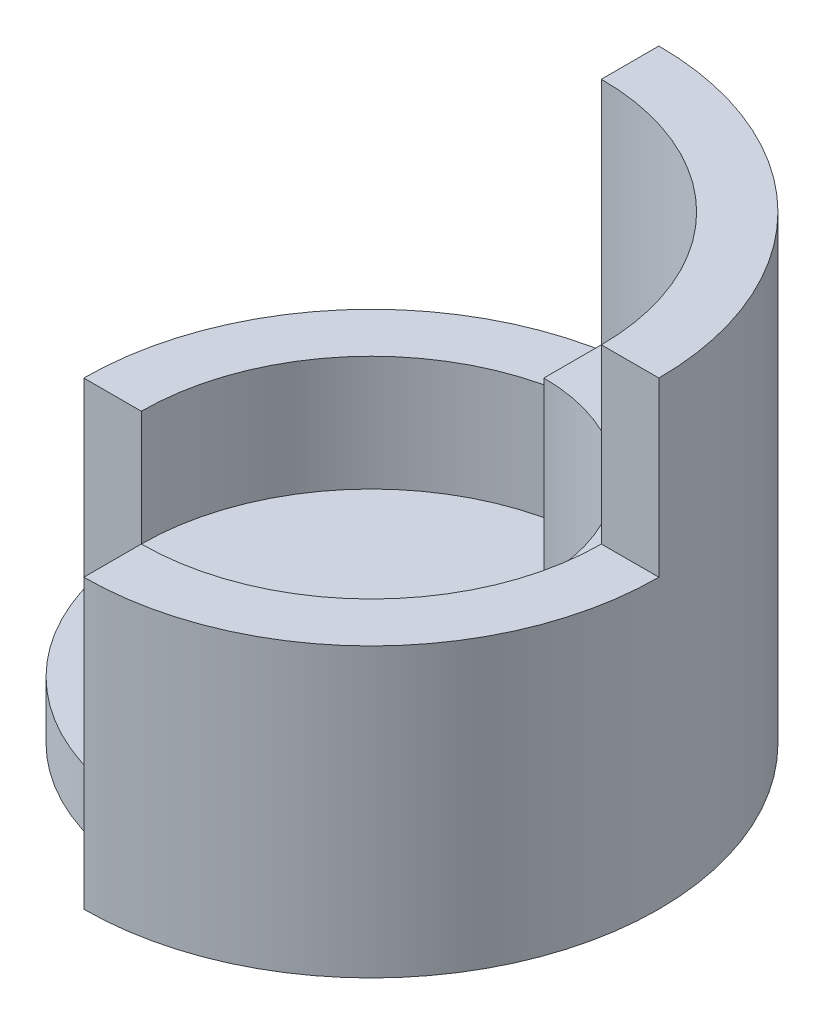
ISO-10303-21;
HEADER;
FILE_DESCRIPTION(('STEP AP214'),'2;1');
FILE_NAME('part.step','',(''),(''),'','','');
FILE_SCHEMA(('AUTOMOTIVE_DESIGN { 1 0 10303 214 1 1 1 1 }'));
ENDSEC;
DATA;
#1=APPLICATION_CONTEXT('core data for automotive mechanical design processes');
#2=APPLICATION_PROTOCOL_DEFINITION('international standard','automotive_design',2000,#1);
#3=PRODUCT_CONTEXT('',#1,'mechanical');
#4=PRODUCT('Part','Part','',(#3));
#5=PRODUCT_RELATED_PRODUCT_CATEGORY('part','',(#4));
#6=PRODUCT_DEFINITION_FORMATION('','',#4);
#7=PRODUCT_DEFINITION_CONTEXT('part definition',#1,'design');
#8=PRODUCT_DEFINITION('design','',#6,#7);
#9=PRODUCT_DEFINITION_SHAPE('','',#8);
#10=(LENGTH_UNIT() NAMED_UNIT(*) SI_UNIT(.MILLI.,.METRE.));
#11=(NAMED_UNIT(*) PLANE_ANGLE_UNIT() SI_UNIT($,.RADIAN.));
#12=(NAMED_UNIT(*) SI_UNIT($,.STERADIAN.) SOLID_ANGLE_UNIT());
#13=UNCERTAINTY_MEASURE_WITH_UNIT(LENGTH_MEASURE(1.E-05),#10,'distance_accuracy_value','');
#14=(GEOMETRIC_REPRESENTATION_CONTEXT(3) GLOBAL_UNCERTAINTY_ASSIGNED_CONTEXT((#13)) GLOBAL_UNIT_ASSIGNED_CONTEXT((#10,
#11,#12)) REPRESENTATION_CONTEXT('',''));
#15=CARTESIAN_POINT('',(0.,0.,0.));
#16=DIRECTION('',(0.,0.,1.));
#17=DIRECTION('',(1.,0.,0.));
#18=AXIS2_PLACEMENT_3D('',#15,#16,#17);
#19=CARTESIAN_POINT('',(0.,5.,-3.));
#20=DIRECTION('',(1.,0.,0.));
#21=DIRECTION('',(0.,0.,-1.));
#22=AXIS2_PLACEMENT_3D('',#19,#20,#21);
#23=PLANE('',#22);
#24=DIRECTION('',(0.,-1.,0.));
#25=VECTOR('',#24,1.);
#26=CARTESIAN_POINT('',(0.,3.,-4.));
#27=LINE('',#26,#25);
#28=CARTESIAN_POINT('',(0.,3.,-4.));
#29=VERTEX_POINT('',#28);
#30=CARTESIAN_POINT('',(0.,1.,-4.));
#31=VERTEX_POINT('',#30);
#32=EDGE_CURVE('E150',#29,#31,#27,.T.);
#33=ORIENTED_EDGE('',*,*,#32,.T.);
#34=DIRECTION('',(0.,0.,1.));
#35=VECTOR('',#34,1.);
#36=CARTESIAN_POINT('',(0.,1.,-3.));
#37=LINE('',#36,#35);
#38=CARTESIAN_POINT('',(0.,1.,-3.));
#39=VERTEX_POINT('',#38);
#40=EDGE_CURVE('E37',#31,#39,#37,.T.);
#41=ORIENTED_EDGE('',*,*,#40,.T.);
#42=DIRECTION('',(0.,-1.,0.));
#43=VECTOR('',#42,1.);
#44=CARTESIAN_POINT('',(0.,5.,-3.));
#45=LINE('',#44,#43);
#46=CARTESIAN_POINT('',(0.,4.,-3.));
#47=VERTEX_POINT('',#46);
#48=EDGE_CURVE('E213',#47,#39,#45,.T.);
#49=ORIENTED_EDGE('',*,*,#48,.F.);
#50=DIRECTION('',(0.,0.,1.));
#51=VECTOR('',#50,1.);
#52=CARTESIAN_POINT('',(0.,4.,-3.));
#53=LINE('',#52,#51);
#54=CARTESIAN_POINT('',(0.,4.,-4.));
#55=VERTEX_POINT('',#54);
#56=EDGE_CURVE('E168',#55,#47,#53,.T.);
#57=ORIENTED_EDGE('',*,*,#56,.F.);
#58=DIRECTION('',(0.,-1.,0.));
#59=VECTOR('',#58,1.);
#60=CARTESIAN_POINT('',(0.,8.,-4.));
#61=LINE('',#60,#59);
#62=CARTESIAN_POINT('',(0.,8.,-4.));
#63=VERTEX_POINT('',#62);
#64=EDGE_CURVE('E185',#63,#55,#61,.T.);
#65=ORIENTED_EDGE('',*,*,#64,.F.);
#66=DIRECTION('',(0.,0.,1.));
#67=VECTOR('',#66,1.);
#68=CARTESIAN_POINT('',(0.,8.,-5.));
#69=LINE('',#68,#67);
#70=CARTESIAN_POINT('',(0.,8.,-5.));
#71=VERTEX_POINT('',#70);
#72=EDGE_CURVE('E182',#71,#63,#69,.T.);
#73=ORIENTED_EDGE('',*,*,#72,.F.);
#74=DIRECTION('',(0.,-1.,0.));
#75=VECTOR('',#74,1.);
#76=CARTESIAN_POINT('',(0.,5.,-5.));
#77=LINE('',#76,#75);
#78=CARTESIAN_POINT('',(0.,3.,-5.));
#79=VERTEX_POINT('',#78);
#80=EDGE_CURVE('E56',#71,#79,#77,.T.);
#81=ORIENTED_EDGE('',*,*,#80,.T.);
#82=DIRECTION('',(0.,0.,-1.));
#83=VECTOR('',#82,1.);
#84=CARTESIAN_POINT('',(0.,3.,-5.));
#85=LINE('',#84,#83);
#86=EDGE_CURVE('E51',#29,#79,#85,.T.);
#87=ORIENTED_EDGE('',*,*,#86,.F.);
#88=EDGE_LOOP('',(#33,#41,#49,#57,#65,#73,#81,#87));
#89=FACE_BOUND('',#88,.T.);
#90=ADVANCED_FACE('F33',(#89),#23,.F.);
#91=CARTESIAN_POINT('',(0.,1.,0.));
#92=DIRECTION('',(0.,1.,0.));
#93=DIRECTION('',(0.,0.,1.));
#94=AXIS2_PLACEMENT_3D('',#91,#92,#93);
#95=PLANE('',#94);
#96=CARTESIAN_POINT('',(0.,1.,0.));
#97=DIRECTION('',(0.,1.,0.));
#98=DIRECTION('',(0.,0.,1.));
#99=AXIS2_PLACEMENT_3D('',#96,#97,#98);
#100=CIRCLE('',#99,1.);
#101=CARTESIAN_POINT('',(0.,1.,1.));
#102=VERTEX_POINT('',#101);
#103=EDGE_CURVE('E209',#102,#102,#100,.T.);
#104=ORIENTED_EDGE('',*,*,#103,.F.);
#105=EDGE_LOOP('',(#104));
#106=FACE_BOUND('',#105,.T.);
#107=ORIENTED_EDGE('',*,*,#40,.F.);
#108=CARTESIAN_POINT('',(0.,1.,0.));
#109=DIRECTION('',(0.,-1.,0.));
#110=DIRECTION('',(0.,0.,1.));
#111=AXIS2_PLACEMENT_3D('',#108,#109,#110);
#112=CIRCLE('',#111,4.00000000000001);
#113=CARTESIAN_POINT('',(-4.,1.,0.));
#114=VERTEX_POINT('',#113);
#115=EDGE_CURVE('E154',#114,#31,#112,.T.);
#116=ORIENTED_EDGE('',*,*,#115,.F.);
#117=CARTESIAN_POINT('',(0.,1.,0.));
#118=DIRECTION('',(0.,1.,0.));
#119=DIRECTION('',(0.,0.,1.));
#120=AXIS2_PLACEMENT_3D('',#117,#118,#119);
#121=CIRCLE('',#120,4.);
#122=CARTESIAN_POINT('',(0.,1.,4.));
#123=VERTEX_POINT('',#122);
#124=EDGE_CURVE('E207',#114,#123,#121,.T.);
#125=ORIENTED_EDGE('',*,*,#124,.T.);
#126=DIRECTION('',(0.,0.,1.));
#127=VECTOR('',#126,1.);
#128=CARTESIAN_POINT('',(0.,1.,3.));
#129=LINE('',#128,#127);
#130=CARTESIAN_POINT('',(0.,1.,3.));
#131=VERTEX_POINT('',#130);
#132=EDGE_CURVE('E192',#131,#123,#129,.T.);
#133=ORIENTED_EDGE('',*,*,#132,.F.);
#134=CARTESIAN_POINT('',(0.,1.,0.));
#135=DIRECTION('',(0.,-1.,0.));
#136=DIRECTION('',(0.,0.,-1.));
#137=AXIS2_PLACEMENT_3D('',#134,#135,#136);
#138=CIRCLE('',#137,3.);
#139=EDGE_CURVE('E188',#39,#131,#138,.T.);
#140=ORIENTED_EDGE('',*,*,#139,.F.);
#141=EDGE_LOOP('',(#107,#116,#125,#133,#140));
#142=FACE_BOUND('',#141,.T.);
#143=ADVANCED_FACE('F254',(#106,#142),#95,.T.);
#144=CARTESIAN_POINT('',(0.,5.,0.));
#145=DIRECTION('',(0.,-1.,0.));
#146=DIRECTION('',(0.,0.,-1.));
#147=AXIS2_PLACEMENT_3D('',#144,#145,#146);
#148=PLANE('',#147);
#149=CARTESIAN_POINT('',(0.,5.,0.));
#150=DIRECTION('',(0.,-1.,0.));
#151=DIRECTION('',(0.,0.,-1.));
#152=AXIS2_PLACEMENT_3D('',#149,#150,#151);
#153=CIRCLE('',#152,4.);
#154=CARTESIAN_POINT('',(0.,5.,4.));
#155=VERTEX_POINT('',#154);
#156=CARTESIAN_POINT('',(4.,5.,0.));
#157=VERTEX_POINT('',#156);
#158=EDGE_CURVE('E164',#155,#157,#153,.F.);
#159=ORIENTED_EDGE('',*,*,#158,.F.);
#160=DIRECTION('',(0.,0.,1.));
#161=VECTOR('',#160,1.);
#162=CARTESIAN_POINT('',(0.,5.,3.));
#163=LINE('',#162,#161);
#164=CARTESIAN_POINT('',(0.,5.,5.));
#165=VERTEX_POINT('',#164);
#166=EDGE_CURVE('E190',#155,#165,#163,.T.);
#167=ORIENTED_EDGE('',*,*,#166,.T.);
#168=CARTESIAN_POINT('',(0.,5.,0.));
#169=DIRECTION('',(0.,-1.,0.));
#170=DIRECTION('',(0.,0.,-1.));
#171=AXIS2_PLACEMENT_3D('',#168,#169,#170);
#172=CIRCLE('',#171,5.);
#173=CARTESIAN_POINT('',(5.,5.,0.));
#174=VERTEX_POINT('',#173);
#175=EDGE_CURVE('E178',#165,#174,#172,.F.);
#176=ORIENTED_EDGE('',*,*,#175,.T.);
#177=DIRECTION('',(-1.,0.,0.));
#178=VECTOR('',#177,1.);
#179=CARTESIAN_POINT('',(6.,5.,0.));
#180=LINE('',#179,#178);
#181=EDGE_CURVE('E172',#174,#157,#180,.T.);
#182=ORIENTED_EDGE('',*,*,#181,.T.);
#183=EDGE_LOOP('',(#159,#167,#176,#182));
#184=FACE_BOUND('',#183,.T.);
#185=ADVANCED_FACE('F282',(#184),#148,.F.);
#186=CARTESIAN_POINT('',(0.,1.,0.));
#187=DIRECTION('',(1.,0.,0.));
#188=DIRECTION('',(0.,0.,-1.));
#189=AXIS2_PLACEMENT_3D('',#186,#187,#188);
#190=PLANE('',#189);
#191=DIRECTION('',(0.,-1.,0.));
#192=VECTOR('',#191,1.);
#193=CARTESIAN_POINT('',(0.,8.,4.));
#194=LINE('',#193,#192);
#195=CARTESIAN_POINT('',(0.,4.,4.));
#196=VERTEX_POINT('',#195);
#197=EDGE_CURVE('E166',#196,#155,#194,.F.);
#198=ORIENTED_EDGE('',*,*,#197,.F.);
#199=DIRECTION('',(0.,0.,1.));
#200=VECTOR('',#199,1.);
#201=CARTESIAN_POINT('',(0.,4.,0.));
#202=LINE('',#201,#200);
#203=CARTESIAN_POINT('',(0.,4.,3.));
#204=VERTEX_POINT('',#203);
#205=EDGE_CURVE('E170',#204,#196,#202,.T.);
#206=ORIENTED_EDGE('',*,*,#205,.F.);
#207=DIRECTION('',(0.,-1.,0.));
#208=VECTOR('',#207,1.);
#209=CARTESIAN_POINT('',(0.,5.,3.));
#210=LINE('',#209,#208);
#211=EDGE_CURVE('E191',#204,#131,#210,.T.);
#212=ORIENTED_EDGE('',*,*,#211,.T.);
#213=ORIENTED_EDGE('',*,*,#132,.T.);
#214=DIRECTION('',(0.,-1.,0.));
#215=VECTOR('',#214,1.);
#216=CARTESIAN_POINT('',(0.,1.,4.));
#217=LINE('',#216,#215);
#218=CARTESIAN_POINT('',(0.,0.,4.));
#219=VERTEX_POINT('',#218);
#220=EDGE_CURVE('E197',#123,#219,#217,.T.);
#221=ORIENTED_EDGE('',*,*,#220,.T.);
#222=DIRECTION('',(0.,0.,1.));
#223=VECTOR('',#222,1.);
#224=CARTESIAN_POINT('',(0.,0.,0.));
#225=LINE('',#224,#223);
#226=CARTESIAN_POINT('',(0.,0.,5.));
#227=VERTEX_POINT('',#226);
#228=EDGE_CURVE('E230',#219,#227,#225,.T.);
#229=ORIENTED_EDGE('',*,*,#228,.T.);
#230=DIRECTION('',(0.,-1.,0.));
#231=VECTOR('',#230,1.);
#232=CARTESIAN_POINT('',(0.,1.,5.));
#233=LINE('',#232,#231);
#234=EDGE_CURVE('E136',#165,#227,#233,.T.);
#235=ORIENTED_EDGE('',*,*,#234,.F.);
#236=ORIENTED_EDGE('',*,*,#166,.F.);
#237=EDGE_LOOP('',(#198,#206,#212,#213,#221,#229,#235,#236));
#238=FACE_BOUND('',#237,.T.);
#239=ADVANCED_FACE('F246',(#238),#190,.F.);
#240=CARTESIAN_POINT('',(0.,5.,0.));
#241=DIRECTION('',(0.,-1.,0.));
#242=DIRECTION('',(0.,0.,-1.));
#243=AXIS2_PLACEMENT_3D('',#240,#241,#242);
#244=CYLINDRICAL_SURFACE('',#243,3.);
#245=CARTESIAN_POINT('',(0.,4.,0.));
#246=DIRECTION('',(0.,1.,0.));
#247=DIRECTION('',(0.,0.,1.));
#248=AXIS2_PLACEMENT_3D('',#245,#246,#247);
#249=CIRCLE('',#248,3.);
#250=EDGE_CURVE('E11',#47,#204,#249,.F.);
#251=ORIENTED_EDGE('',*,*,#250,.F.);
#252=ORIENTED_EDGE('',*,*,#48,.T.);
#253=ORIENTED_EDGE('',*,*,#139,.T.);
#254=ORIENTED_EDGE('',*,*,#211,.F.);
#255=EDGE_LOOP('',(#251,#252,#253,#254));
#256=FACE_BOUND('',#255,.T.);
#257=ADVANCED_FACE('F258',(#256),#244,.F.);
#258=CARTESIAN_POINT('',(0.,8.,0.));
#259=DIRECTION('',(0.,-1.,0.));
#260=DIRECTION('',(0.,0.,-1.));
#261=AXIS2_PLACEMENT_3D('',#258,#259,#260);
#262=PLANE('',#261);
#263=CARTESIAN_POINT('',(0.,8.,0.));
#264=DIRECTION('',(0.,1.,0.));
#265=DIRECTION('',(0.,0.,1.));
#266=AXIS2_PLACEMENT_3D('',#263,#264,#265);
#267=CIRCLE('',#266,4.);
#268=CARTESIAN_POINT('',(4.,8.,0.));
#269=VERTEX_POINT('',#268);
#270=EDGE_CURVE('E162',#269,#63,#267,.T.);
#271=ORIENTED_EDGE('',*,*,#270,.F.);
#272=DIRECTION('',(1.,0.,0.));
#273=VECTOR('',#272,1.);
#274=CARTESIAN_POINT('',(0.,8.,0.));
#275=LINE('',#274,#273);
#276=CARTESIAN_POINT('',(4.99999999999999,8.,0.));
#277=VERTEX_POINT('',#276);
#278=EDGE_CURVE('E195',#269,#277,#275,.T.);
#279=ORIENTED_EDGE('',*,*,#278,.T.);
#280=CARTESIAN_POINT('',(0.,8.,0.));
#281=DIRECTION('',(0.,1.,0.));
#282=DIRECTION('',(0.,0.,-1.));
#283=AXIS2_PLACEMENT_3D('',#280,#281,#282);
#284=CIRCLE('',#283,5.);
#285=EDGE_CURVE('E180',#277,#71,#284,.T.);
#286=ORIENTED_EDGE('',*,*,#285,.T.);
#287=ORIENTED_EDGE('',*,*,#72,.T.);
#288=EDGE_LOOP('',(#271,#279,#286,#287));
#289=FACE_BOUND('',#288,.T.);
#290=ADVANCED_FACE('F301',(#289),#262,.F.);
#291=CARTESIAN_POINT('',(6.,5.,0.));
#292=DIRECTION('',(0.,0.,-1.));
#293=DIRECTION('',(-1.,0.,0.));
#294=AXIS2_PLACEMENT_3D('',#291,#292,#293);
#295=PLANE('',#294);
#296=DIRECTION('',(0.,-1.,0.));
#297=VECTOR('',#296,1.);
#298=CARTESIAN_POINT('',(4.,8.,0.));
#299=LINE('',#298,#297);
#300=EDGE_CURVE('E43',#157,#269,#299,.F.);
#301=ORIENTED_EDGE('',*,*,#300,.F.);
#302=ORIENTED_EDGE('',*,*,#181,.F.);
#303=DIRECTION('',(0.,-1.,0.));
#304=VECTOR('',#303,1.);
#305=CARTESIAN_POINT('',(5.,1.,0.));
#306=LINE('',#305,#304);
#307=EDGE_CURVE('E175',#174,#277,#306,.F.);
#308=ORIENTED_EDGE('',*,*,#307,.T.);
#309=ORIENTED_EDGE('',*,*,#278,.F.);
#310=EDGE_LOOP('',(#301,#302,#308,#309));
#311=FACE_BOUND('',#310,.T.);
#312=ADVANCED_FACE('F297',(#311),#295,.F.);
#313=CARTESIAN_POINT('',(0.,1.,0.));
#314=DIRECTION('',(0.,-1.,0.));
#315=DIRECTION('',(0.,0.,-1.));
#316=AXIS2_PLACEMENT_3D('',#313,#314,#315);
#317=CYLINDRICAL_SURFACE('',#316,4.);
#318=CARTESIAN_POINT('',(0.,0.,0.));
#319=DIRECTION('',(0.,1.,0.));
#320=DIRECTION('',(0.,0.,1.));
#321=AXIS2_PLACEMENT_3D('',#318,#319,#320);
#322=CIRCLE('',#321,4.);
#323=CARTESIAN_POINT('',(-4.,0.,0.));
#324=VERTEX_POINT('',#323);
#325=EDGE_CURVE('E227',#324,#219,#322,.T.);
#326=ORIENTED_EDGE('',*,*,#325,.T.);
#327=ORIENTED_EDGE('',*,*,#220,.F.);
#328=ORIENTED_EDGE('',*,*,#124,.F.);
#329=DIRECTION('',(0.,-1.,0.));
#330=VECTOR('',#329,1.);
#331=CARTESIAN_POINT('',(-4.,1.,0.));
#332=LINE('',#331,#330);
#333=EDGE_CURVE('E137',#114,#324,#332,.T.);
#334=ORIENTED_EDGE('',*,*,#333,.T.);
#335=EDGE_LOOP('',(#326,#327,#328,#334));
#336=FACE_BOUND('',#335,.T.);
#337=ADVANCED_FACE('F238',(#336),#317,.T.);
#338=CARTESIAN_POINT('',(0.,1.,0.));
#339=DIRECTION('',(0.,-1.,0.));
#340=DIRECTION('',(0.,0.,-1.));
#341=AXIS2_PLACEMENT_3D('',#338,#339,#340);
#342=CYLINDRICAL_SURFACE('',#341,5.);
#343=ORIENTED_EDGE('',*,*,#307,.F.);
#344=ORIENTED_EDGE('',*,*,#175,.F.);
#345=ORIENTED_EDGE('',*,*,#234,.T.);
#346=CARTESIAN_POINT('',(0.,0.,0.));
#347=DIRECTION('',(0.,1.,0.));
#348=DIRECTION('',(0.,0.,1.));
#349=AXIS2_PLACEMENT_3D('',#346,#347,#348);
#350=CIRCLE('',#349,5.);
#351=CARTESIAN_POINT('',(-5.,0.,0.));
#352=VERTEX_POINT('',#351);
#353=EDGE_CURVE('E132',#352,#227,#350,.F.);
#354=ORIENTED_EDGE('',*,*,#353,.F.);
#355=DIRECTION('',(0.,-1.,0.));
#356=VECTOR('',#355,1.);
#357=CARTESIAN_POINT('',(-5.,1.,0.));
#358=LINE('',#357,#356);
#359=CARTESIAN_POINT('',(-5.,3.,0.));
#360=VERTEX_POINT('',#359);
#361=EDGE_CURVE('E126',#360,#352,#358,.T.);
#362=ORIENTED_EDGE('',*,*,#361,.F.);
#363=CARTESIAN_POINT('',(0.,3.,0.));
#364=DIRECTION('',(0.,1.,0.));
#365=DIRECTION('',(0.,0.,1.));
#366=AXIS2_PLACEMENT_3D('',#363,#364,#365);
#367=CIRCLE('',#366,5.00000000000002);
#368=EDGE_CURVE('E130',#79,#360,#367,.T.);
#369=ORIENTED_EDGE('',*,*,#368,.F.);
#370=ORIENTED_EDGE('',*,*,#80,.F.);
#371=ORIENTED_EDGE('',*,*,#285,.F.);
#372=EDGE_LOOP('',(#343,#344,#345,#354,#362,#369,#370,#371));
#373=FACE_BOUND('',#372,.T.);
#374=ADVANCED_FACE('F129',(#373),#342,.T.);
#375=CARTESIAN_POINT('',(0.,1.,0.));
#376=DIRECTION('',(0.,-1.,0.));
#377=DIRECTION('',(0.,0.,-1.));
#378=AXIS2_PLACEMENT_3D('',#375,#376,#377);
#379=CYLINDRICAL_SURFACE('',#378,1.);
#380=ORIENTED_EDGE('',*,*,#103,.T.);
#381=EDGE_LOOP('',(#380));
#382=FACE_BOUND('',#381,.T.);
#383=CARTESIAN_POINT('',(0.,0.,0.));
#384=DIRECTION('',(0.,1.,0.));
#385=DIRECTION('',(0.,0.,1.));
#386=AXIS2_PLACEMENT_3D('',#383,#384,#385);
#387=CIRCLE('',#386,1.);
#388=CARTESIAN_POINT('',(0.,0.,1.));
#389=VERTEX_POINT('',#388);
#390=EDGE_CURVE('E212',#389,#389,#387,.T.);
#391=ORIENTED_EDGE('',*,*,#390,.F.);
#392=EDGE_LOOP('',(#391));
#393=FACE_BOUND('',#392,.T.);
#394=ADVANCED_FACE('F35',(#382,#393),#379,.F.);
#395=CARTESIAN_POINT('',(0.,1.,0.));
#396=DIRECTION('',(0.,0.,-1.));
#397=DIRECTION('',(-1.,0.,0.));
#398=AXIS2_PLACEMENT_3D('',#395,#396,#397);
#399=PLANE('',#398);
#400=DIRECTION('',(1.,0.,0.));
#401=VECTOR('',#400,1.);
#402=CARTESIAN_POINT('',(0.,0.,0.));
#403=LINE('',#402,#401);
#404=EDGE_CURVE('E224',#352,#324,#403,.T.);
#405=ORIENTED_EDGE('',*,*,#404,.T.);
#406=ORIENTED_EDGE('',*,*,#333,.F.);
#407=DIRECTION('',(0.,-1.,0.));
#408=VECTOR('',#407,1.);
#409=CARTESIAN_POINT('',(-4.,3.,0.));
#410=LINE('',#409,#408);
#411=CARTESIAN_POINT('',(-4.,3.,0.));
#412=VERTEX_POINT('',#411);
#413=EDGE_CURVE('E147',#412,#114,#410,.T.);
#414=ORIENTED_EDGE('',*,*,#413,.F.);
#415=DIRECTION('',(1.,0.,0.));
#416=VECTOR('',#415,1.);
#417=CARTESIAN_POINT('',(-5.,3.,0.));
#418=LINE('',#417,#416);
#419=EDGE_CURVE('E141',#360,#412,#418,.T.);
#420=ORIENTED_EDGE('',*,*,#419,.F.);
#421=ORIENTED_EDGE('',*,*,#361,.T.);
#422=EDGE_LOOP('',(#405,#406,#414,#420,#421));
#423=FACE_BOUND('',#422,.T.);
#424=ADVANCED_FACE('F144',(#423),#399,.F.);
#425=CARTESIAN_POINT('',(0.,0.,0.));
#426=DIRECTION('',(0.,1.,0.));
#427=DIRECTION('',(0.,0.,1.));
#428=AXIS2_PLACEMENT_3D('',#425,#426,#427);
#429=PLANE('',#428);
#430=ORIENTED_EDGE('',*,*,#390,.T.);
#431=EDGE_LOOP('',(#430));
#432=FACE_BOUND('',#431,.T.);
#433=ORIENTED_EDGE('',*,*,#325,.F.);
#434=ORIENTED_EDGE('',*,*,#404,.F.);
#435=ORIENTED_EDGE('',*,*,#353,.T.);
#436=ORIENTED_EDGE('',*,*,#228,.F.);
#437=EDGE_LOOP('',(#433,#434,#435,#436));
#438=FACE_BOUND('',#437,.T.);
#439=ADVANCED_FACE('F242',(#432,#438),#429,.F.);
#440=CARTESIAN_POINT('',(0.,4.,0.));
#441=DIRECTION('',(0.,1.,0.));
#442=DIRECTION('',(0.,0.,1.));
#443=AXIS2_PLACEMENT_3D('',#440,#441,#442);
#444=PLANE('',#443);
#445=ORIENTED_EDGE('',*,*,#205,.T.);
#446=CARTESIAN_POINT('',(0.,4.,0.));
#447=DIRECTION('',(0.,1.,0.));
#448=DIRECTION('',(0.,0.,1.));
#449=AXIS2_PLACEMENT_3D('',#446,#447,#448);
#450=CIRCLE('',#449,4.);
#451=EDGE_CURVE('E159',#196,#55,#450,.T.);
#452=ORIENTED_EDGE('',*,*,#451,.T.);
#453=ORIENTED_EDGE('',*,*,#56,.T.);
#454=ORIENTED_EDGE('',*,*,#250,.T.);
#455=EDGE_LOOP('',(#445,#452,#453,#454));
#456=FACE_BOUND('',#455,.T.);
#457=ADVANCED_FACE('F273',(#456),#444,.T.);
#458=CARTESIAN_POINT('',(0.,8.,0.));
#459=DIRECTION('',(0.,-1.,0.));
#460=DIRECTION('',(0.,0.,-1.));
#461=AXIS2_PLACEMENT_3D('',#458,#459,#460);
#462=CYLINDRICAL_SURFACE('',#461,4.);
#463=ORIENTED_EDGE('',*,*,#64,.T.);
#464=ORIENTED_EDGE('',*,*,#451,.F.);
#465=ORIENTED_EDGE('',*,*,#197,.T.);
#466=ORIENTED_EDGE('',*,*,#158,.T.);
#467=ORIENTED_EDGE('',*,*,#300,.T.);
#468=ORIENTED_EDGE('',*,*,#270,.T.);
#469=EDGE_LOOP('',(#463,#464,#465,#466,#467,#468));
#470=FACE_BOUND('',#469,.T.);
#471=ADVANCED_FACE('F266',(#470),#462,.F.);
#472=CARTESIAN_POINT('',(0.,3.,0.));
#473=DIRECTION('',(0.,-1.,0.));
#474=DIRECTION('',(0.,0.,-1.));
#475=AXIS2_PLACEMENT_3D('',#472,#473,#474);
#476=CYLINDRICAL_SURFACE('',#475,4.00000000000001);
#477=ORIENTED_EDGE('',*,*,#115,.T.);
#478=ORIENTED_EDGE('',*,*,#32,.F.);
#479=CARTESIAN_POINT('',(0.,3.,0.));
#480=DIRECTION('',(0.,-1.,0.));
#481=DIRECTION('',(0.,0.,1.));
#482=AXIS2_PLACEMENT_3D('',#479,#480,#481);
#483=CIRCLE('',#482,4.00000000000001);
#484=EDGE_CURVE('E156',#412,#29,#483,.T.);
#485=ORIENTED_EDGE('',*,*,#484,.F.);
#486=ORIENTED_EDGE('',*,*,#413,.T.);
#487=EDGE_LOOP('',(#477,#478,#485,#486));
#488=FACE_BOUND('',#487,.T.);
#489=ADVANCED_FACE('F263',(#488),#476,.F.);
#490=CARTESIAN_POINT('',(0.,3.,0.));
#491=DIRECTION('',(0.,1.,0.));
#492=DIRECTION('',(0.,0.,1.));
#493=AXIS2_PLACEMENT_3D('',#490,#491,#492);
#494=PLANE('',#493);
#495=ORIENTED_EDGE('',*,*,#484,.T.);
#496=ORIENTED_EDGE('',*,*,#86,.T.);
#497=ORIENTED_EDGE('',*,*,#368,.T.);
#498=ORIENTED_EDGE('',*,*,#419,.T.);
#499=EDGE_LOOP('',(#495,#496,#497,#498));
#500=FACE_BOUND('',#499,.T.);
#501=ADVANCED_FACE('F140',(#500),#494,.T.);
#502=CLOSED_SHELL('',(#90,#143,#185,#239,#257,#290,#312,#337,#374,#394,#424,#439,#457,#471,#489,#501));
#503=MANIFOLD_SOLID_BREP('B2',#502);
#504=ADVANCED_BREP_SHAPE_REPRESENTATION('',(#18,#503),#14);
#505=SHAPE_DEFINITION_REPRESENTATION(#9,#504);
ENDSEC;
END-ISO-10303-21;
